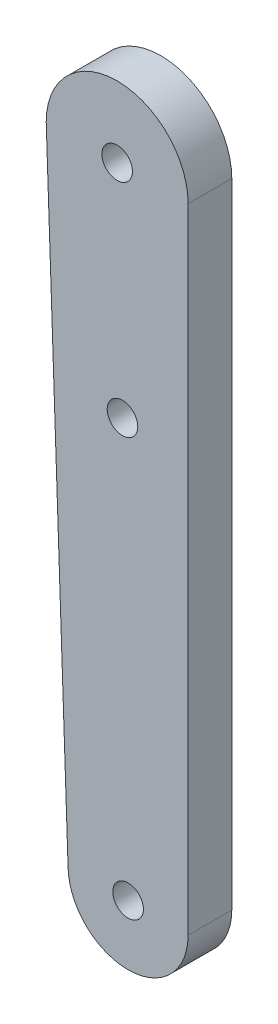
ISO-10303-21;
HEADER;
FILE_DESCRIPTION(('STEP AP214'),'2;1');
FILE_NAME('part.step','',(''),(''),'','','');
FILE_SCHEMA(('AUTOMOTIVE_DESIGN { 1 0 10303 214 1 1 1 1 }'));
ENDSEC;
DATA;
#1=APPLICATION_CONTEXT('core data for automotive mechanical design processes');
#2=APPLICATION_PROTOCOL_DEFINITION('international standard','automotive_design',2000,#1);
#3=PRODUCT_CONTEXT('',#1,'mechanical');
#4=PRODUCT('Part','Part','',(#3));
#5=PRODUCT_RELATED_PRODUCT_CATEGORY('part','',(#4));
#6=PRODUCT_DEFINITION_FORMATION('','',#4);
#7=PRODUCT_DEFINITION_CONTEXT('part definition',#1,'design');
#8=PRODUCT_DEFINITION('design','',#6,#7);
#9=PRODUCT_DEFINITION_SHAPE('','',#8);
#10=(LENGTH_UNIT() NAMED_UNIT(*) SI_UNIT(.MILLI.,.METRE.));
#11=(NAMED_UNIT(*) PLANE_ANGLE_UNIT() SI_UNIT($,.RADIAN.));
#12=(NAMED_UNIT(*) SI_UNIT($,.STERADIAN.) SOLID_ANGLE_UNIT());
#13=UNCERTAINTY_MEASURE_WITH_UNIT(LENGTH_MEASURE(1.E-05),#10,'distance_accuracy_value','');
#14=(GEOMETRIC_REPRESENTATION_CONTEXT(3) GLOBAL_UNCERTAINTY_ASSIGNED_CONTEXT((#13)) GLOBAL_UNIT_ASSIGNED_CONTEXT((#10,
#11,#12)) REPRESENTATION_CONTEXT('',''));
#15=CARTESIAN_POINT('',(0.,0.,0.));
#16=DIRECTION('',(0.,0.,1.));
#17=DIRECTION('',(1.,0.,0.));
#18=AXIS2_PLACEMENT_3D('',#15,#16,#17);
#19=CARTESIAN_POINT('',(-5.50068845938101,6.99331729577745,4.));
#20=DIRECTION('',(0.,0.,1.));
#21=DIRECTION('',(1.,0.,0.));
#22=AXIS2_PLACEMENT_3D('',#19,#20,#21);
#23=PLANE('',#22);
#24=CARTESIAN_POINT('',(-5.50068845938101,6.99331729577745,4.));
#25=DIRECTION('',(0.,0.,1.));
#26=DIRECTION('',(1.,0.,0.));
#27=AXIS2_PLACEMENT_3D('',#24,#25,#26);
#28=CIRCLE('',#27,1.4);
#29=CARTESIAN_POINT('',(-4.10068845938101,6.99331729577745,4.));
#30=VERTEX_POINT('',#29);
#31=EDGE_CURVE('E116',#30,#30,#28,.T.);
#32=ORIENTED_EDGE('',*,*,#31,.F.);
#33=EDGE_LOOP('',(#32));
#34=FACE_BOUND('',#33,.T.);
#35=CARTESIAN_POINT('',(-5.50068845938101,6.99331729577745,4.));
#36=DIRECTION('',(0.,0.,1.));
#37=DIRECTION('',(1.,0.,0.));
#38=AXIS2_PLACEMENT_3D('',#35,#36,#37);
#39=CIRCLE('',#38,5.5);
#40=CARTESIAN_POINT('',(-11.000688459381,6.99331729577745,4.));
#41=VERTEX_POINT('',#40);
#42=CARTESIAN_POINT('',(-0.000688459381010219,6.99331729577743,4.));
#43=VERTEX_POINT('',#42);
#44=EDGE_CURVE('E86',#41,#43,#39,.T.);
#45=ORIENTED_EDGE('',*,*,#44,.T.);
#46=DIRECTION('',(0.,1.,0.));
#47=VECTOR('',#46,1.);
#48=CARTESIAN_POINT('',(-0.000688459381010219,6.99331729577743,4.));
#49=LINE('',#48,#47);
#50=CARTESIAN_POINT('',(-0.000688459380886186,65.0160917207258,4.));
#51=VERTEX_POINT('',#50);
#52=EDGE_CURVE('E81',#43,#51,#49,.T.);
#53=ORIENTED_EDGE('',*,*,#52,.T.);
#54=CARTESIAN_POINT('',(-6.50068845938089,65.0160917207258,4.));
#55=DIRECTION('',(0.,0.,1.));
#56=DIRECTION('',(1.,0.,0.));
#57=AXIS2_PLACEMENT_3D('',#54,#55,#56);
#58=CIRCLE('',#57,6.5);
#59=CARTESIAN_POINT('',(-13.0006884593809,65.0160917207258,4.));
#60=VERTEX_POINT('',#59);
#61=EDGE_CURVE('E84',#51,#60,#58,.T.);
#62=ORIENTED_EDGE('',*,*,#61,.T.);
#63=DIRECTION('',(0.0344487651634171,-0.999406465147547,0.));
#64=VECTOR('',#63,1.);
#65=CARTESIAN_POINT('',(-13.0006884593809,65.0160917207258,4.));
#66=LINE('',#65,#64);
#67=EDGE_CURVE('E51',#60,#41,#66,.T.);
#68=ORIENTED_EDGE('',*,*,#67,.T.);
#69=EDGE_LOOP('',(#45,#53,#62,#68));
#70=FACE_BOUND('',#69,.T.);
#71=CARTESIAN_POINT('',(-6.50068845938089,65.0160917207258,4.));
#72=DIRECTION('',(0.,0.,1.));
#73=DIRECTION('',(1.,0.,0.));
#74=AXIS2_PLACEMENT_3D('',#71,#72,#73);
#75=CIRCLE('',#74,1.4);
#76=CARTESIAN_POINT('',(-5.10068845938089,65.0160917207258,4.));
#77=VERTEX_POINT('',#76);
#78=EDGE_CURVE('E101',#77,#77,#75,.T.);
#79=ORIENTED_EDGE('',*,*,#78,.F.);
#80=EDGE_LOOP('',(#79));
#81=FACE_BOUND('',#80,.T.);
#82=CARTESIAN_POINT('',(-6.01275635098238,45.0160917207258,4.));
#83=DIRECTION('',(0.,0.,1.));
#84=DIRECTION('',(1.,0.,0.));
#85=AXIS2_PLACEMENT_3D('',#82,#83,#84);
#86=CIRCLE('',#85,1.4);
#87=CARTESIAN_POINT('',(-4.61275635098238,45.0160917207258,4.));
#88=VERTEX_POINT('',#87);
#89=EDGE_CURVE('E122',#88,#88,#86,.T.);
#90=ORIENTED_EDGE('',*,*,#89,.F.);
#91=EDGE_LOOP('',(#90));
#92=FACE_BOUND('',#91,.T.);
#93=ADVANCED_FACE('F34',(#34,#70,#81,#92),#23,.T.);
#94=CARTESIAN_POINT('',(-5.50068845938101,6.99331729577745,0.));
#95=DIRECTION('',(0.,0.,1.));
#96=DIRECTION('',(1.,0.,0.));
#97=AXIS2_PLACEMENT_3D('',#94,#95,#96);
#98=PLANE('',#97);
#99=CARTESIAN_POINT('',(-5.50068845938101,6.99331729577745,0.));
#100=DIRECTION('',(0.,0.,1.));
#101=DIRECTION('',(1.,0.,0.));
#102=AXIS2_PLACEMENT_3D('',#99,#100,#101);
#103=CIRCLE('',#102,5.5);
#104=CARTESIAN_POINT('',(-11.000688459381,6.99331729577745,0.));
#105=VERTEX_POINT('',#104);
#106=CARTESIAN_POINT('',(-0.000688459381010219,6.99331729577743,0.));
#107=VERTEX_POINT('',#106);
#108=EDGE_CURVE('E98',#105,#107,#103,.T.);
#109=ORIENTED_EDGE('',*,*,#108,.F.);
#110=DIRECTION('',(0.0344487651634171,-0.999406465147547,0.));
#111=VECTOR('',#110,1.);
#112=CARTESIAN_POINT('',(-13.0006884593809,65.0160917207258,0.));
#113=LINE('',#112,#111);
#114=CARTESIAN_POINT('',(-13.0006884593809,65.0160917207258,0.));
#115=VERTEX_POINT('',#114);
#116=EDGE_CURVE('E74',#115,#105,#113,.T.);
#117=ORIENTED_EDGE('',*,*,#116,.F.);
#118=CARTESIAN_POINT('',(-6.50068845938089,65.0160917207258,0.));
#119=DIRECTION('',(0.,0.,1.));
#120=DIRECTION('',(1.,0.,0.));
#121=AXIS2_PLACEMENT_3D('',#118,#119,#120);
#122=CIRCLE('',#121,6.5);
#123=CARTESIAN_POINT('',(-0.000688459380886186,65.0160917207258,0.));
#124=VERTEX_POINT('',#123);
#125=EDGE_CURVE('E68',#124,#115,#122,.T.);
#126=ORIENTED_EDGE('',*,*,#125,.F.);
#127=DIRECTION('',(0.,1.,0.));
#128=VECTOR('',#127,1.);
#129=CARTESIAN_POINT('',(-0.000688459381010219,6.99331729577743,0.));
#130=LINE('',#129,#128);
#131=EDGE_CURVE('E90',#107,#124,#130,.T.);
#132=ORIENTED_EDGE('',*,*,#131,.F.);
#133=EDGE_LOOP('',(#109,#117,#126,#132));
#134=FACE_BOUND('',#133,.T.);
#135=CARTESIAN_POINT('',(-6.50068845938089,65.0160917207258,0.));
#136=DIRECTION('',(0.,0.,1.));
#137=DIRECTION('',(1.,0.,0.));
#138=AXIS2_PLACEMENT_3D('',#135,#136,#137);
#139=CIRCLE('',#138,1.4);
#140=CARTESIAN_POINT('',(-5.10068845938089,65.0160917207258,0.));
#141=VERTEX_POINT('',#140);
#142=EDGE_CURVE('E113',#141,#141,#139,.T.);
#143=ORIENTED_EDGE('',*,*,#142,.T.);
#144=EDGE_LOOP('',(#143));
#145=FACE_BOUND('',#144,.T.);
#146=CARTESIAN_POINT('',(-5.50068845938101,6.99331729577745,0.));
#147=DIRECTION('',(0.,0.,1.));
#148=DIRECTION('',(1.,0.,0.));
#149=AXIS2_PLACEMENT_3D('',#146,#147,#148);
#150=CIRCLE('',#149,1.4);
#151=CARTESIAN_POINT('',(-4.10068845938101,6.99331729577745,0.));
#152=VERTEX_POINT('',#151);
#153=EDGE_CURVE('E119',#152,#152,#150,.T.);
#154=ORIENTED_EDGE('',*,*,#153,.T.);
#155=EDGE_LOOP('',(#154));
#156=FACE_BOUND('',#155,.T.);
#157=CARTESIAN_POINT('',(-6.01275635098238,45.0160917207258,0.));
#158=DIRECTION('',(0.,0.,1.));
#159=DIRECTION('',(1.,0.,0.));
#160=AXIS2_PLACEMENT_3D('',#157,#158,#159);
#161=CIRCLE('',#160,1.4);
#162=CARTESIAN_POINT('',(-4.61275635098238,45.0160917207258,0.));
#163=VERTEX_POINT('',#162);
#164=EDGE_CURVE('E125',#163,#163,#161,.T.);
#165=ORIENTED_EDGE('',*,*,#164,.T.);
#166=EDGE_LOOP('',(#165));
#167=FACE_BOUND('',#166,.T.);
#168=ADVANCED_FACE('F109',(#134,#145,#156,#167),#98,.F.);
#169=CARTESIAN_POINT('',(-5.50068845938101,6.99331729577745,4.));
#170=DIRECTION('',(0.,0.,-1.));
#171=DIRECTION('',(-1.,0.,0.));
#172=AXIS2_PLACEMENT_3D('',#169,#170,#171);
#173=CYLINDRICAL_SURFACE('',#172,5.5);
#174=ORIENTED_EDGE('',*,*,#108,.T.);
#175=DIRECTION('',(0.,0.,-1.));
#176=VECTOR('',#175,1.);
#177=CARTESIAN_POINT('',(-0.000688459381010219,6.99331729577743,4.));
#178=LINE('',#177,#176);
#179=EDGE_CURVE('E11',#43,#107,#178,.T.);
#180=ORIENTED_EDGE('',*,*,#179,.F.);
#181=ORIENTED_EDGE('',*,*,#44,.F.);
#182=DIRECTION('',(0.,0.,-1.));
#183=VECTOR('',#182,1.);
#184=CARTESIAN_POINT('',(-11.000688459381,6.99331729577745,4.));
#185=LINE('',#184,#183);
#186=EDGE_CURVE('E94',#41,#105,#185,.T.);
#187=ORIENTED_EDGE('',*,*,#186,.T.);
#188=EDGE_LOOP('',(#174,#180,#181,#187));
#189=FACE_BOUND('',#188,.T.);
#190=ADVANCED_FACE('F36',(#189),#173,.T.);
#191=CARTESIAN_POINT('',(-0.000688459381010219,6.99331729577743,4.));
#192=DIRECTION('',(-1.,0.,0.));
#193=DIRECTION('',(0.,-1.,0.));
#194=AXIS2_PLACEMENT_3D('',#191,#192,#193);
#195=PLANE('',#194);
#196=ORIENTED_EDGE('',*,*,#131,.T.);
#197=DIRECTION('',(0.,0.,-1.));
#198=VECTOR('',#197,1.);
#199=CARTESIAN_POINT('',(-0.000688459380886186,65.0160917207258,4.));
#200=LINE('',#199,#198);
#201=EDGE_CURVE('E43',#51,#124,#200,.T.);
#202=ORIENTED_EDGE('',*,*,#201,.F.);
#203=ORIENTED_EDGE('',*,*,#52,.F.);
#204=ORIENTED_EDGE('',*,*,#179,.T.);
#205=EDGE_LOOP('',(#196,#202,#203,#204));
#206=FACE_BOUND('',#205,.T.);
#207=ADVANCED_FACE('F89',(#206),#195,.F.);
#208=CARTESIAN_POINT('',(-6.50068845938089,65.0160917207258,4.));
#209=DIRECTION('',(0.,0.,-1.));
#210=DIRECTION('',(-1.,0.,0.));
#211=AXIS2_PLACEMENT_3D('',#208,#209,#210);
#212=CYLINDRICAL_SURFACE('',#211,6.5);
#213=ORIENTED_EDGE('',*,*,#125,.T.);
#214=DIRECTION('',(0.,0.,-1.));
#215=VECTOR('',#214,1.);
#216=CARTESIAN_POINT('',(-13.0006884593809,65.0160917207258,4.));
#217=LINE('',#216,#215);
#218=EDGE_CURVE('E91',#60,#115,#217,.T.);
#219=ORIENTED_EDGE('',*,*,#218,.F.);
#220=ORIENTED_EDGE('',*,*,#61,.F.);
#221=ORIENTED_EDGE('',*,*,#201,.T.);
#222=EDGE_LOOP('',(#213,#219,#220,#221));
#223=FACE_BOUND('',#222,.T.);
#224=ADVANCED_FACE('F92',(#223),#212,.T.);
#225=CARTESIAN_POINT('',(-13.0006884593809,65.0160917207258,4.));
#226=DIRECTION('',(0.999406465147547,0.0344487651634171,0.));
#227=DIRECTION('',(-0.0344487651634171,0.999406465147547,0.));
#228=AXIS2_PLACEMENT_3D('',#225,#226,#227);
#229=PLANE('',#228);
#230=ORIENTED_EDGE('',*,*,#116,.T.);
#231=ORIENTED_EDGE('',*,*,#186,.F.);
#232=ORIENTED_EDGE('',*,*,#67,.F.);
#233=ORIENTED_EDGE('',*,*,#218,.T.);
#234=EDGE_LOOP('',(#230,#231,#232,#233));
#235=FACE_BOUND('',#234,.T.);
#236=ADVANCED_FACE('F106',(#235),#229,.F.);
#237=CARTESIAN_POINT('',(-6.50068845938089,65.0160917207258,4.));
#238=DIRECTION('',(0.,0.,-1.));
#239=DIRECTION('',(-1.,0.,0.));
#240=AXIS2_PLACEMENT_3D('',#237,#238,#239);
#241=CYLINDRICAL_SURFACE('',#240,1.4);
#242=ORIENTED_EDGE('',*,*,#78,.T.);
#243=EDGE_LOOP('',(#242));
#244=FACE_BOUND('',#243,.T.);
#245=ORIENTED_EDGE('',*,*,#142,.F.);
#246=EDGE_LOOP('',(#245));
#247=FACE_BOUND('',#246,.T.);
#248=ADVANCED_FACE('F143',(#244,#247),#241,.F.);
#249=CARTESIAN_POINT('',(-5.50068845938101,6.99331729577745,4.));
#250=DIRECTION('',(0.,0.,-1.));
#251=DIRECTION('',(-1.,0.,0.));
#252=AXIS2_PLACEMENT_3D('',#249,#250,#251);
#253=CYLINDRICAL_SURFACE('',#252,1.4);
#254=ORIENTED_EDGE('',*,*,#31,.T.);
#255=EDGE_LOOP('',(#254));
#256=FACE_BOUND('',#255,.T.);
#257=ORIENTED_EDGE('',*,*,#153,.F.);
#258=EDGE_LOOP('',(#257));
#259=FACE_BOUND('',#258,.T.);
#260=ADVANCED_FACE('F189',(#256,#259),#253,.F.);
#261=CARTESIAN_POINT('',(-6.01275635098238,45.0160917207258,4.));
#262=DIRECTION('',(0.,0.,-1.));
#263=DIRECTION('',(-1.,0.,0.));
#264=AXIS2_PLACEMENT_3D('',#261,#262,#263);
#265=CYLINDRICAL_SURFACE('',#264,1.4);
#266=ORIENTED_EDGE('',*,*,#89,.T.);
#267=EDGE_LOOP('',(#266));
#268=FACE_BOUND('',#267,.T.);
#269=ORIENTED_EDGE('',*,*,#164,.F.);
#270=EDGE_LOOP('',(#269));
#271=FACE_BOUND('',#270,.T.);
#272=ADVANCED_FACE('F131',(#268,#271),#265,.F.);
#273=CLOSED_SHELL('',(#93,#168,#190,#207,#224,#236,#248,#260,#272));
#274=MANIFOLD_SOLID_BREP('B2',#273);
#275=ADVANCED_BREP_SHAPE_REPRESENTATION('',(#18,#274),#14);
#276=SHAPE_DEFINITION_REPRESENTATION(#9,#275);
ENDSEC;
END-ISO-10303-21;
